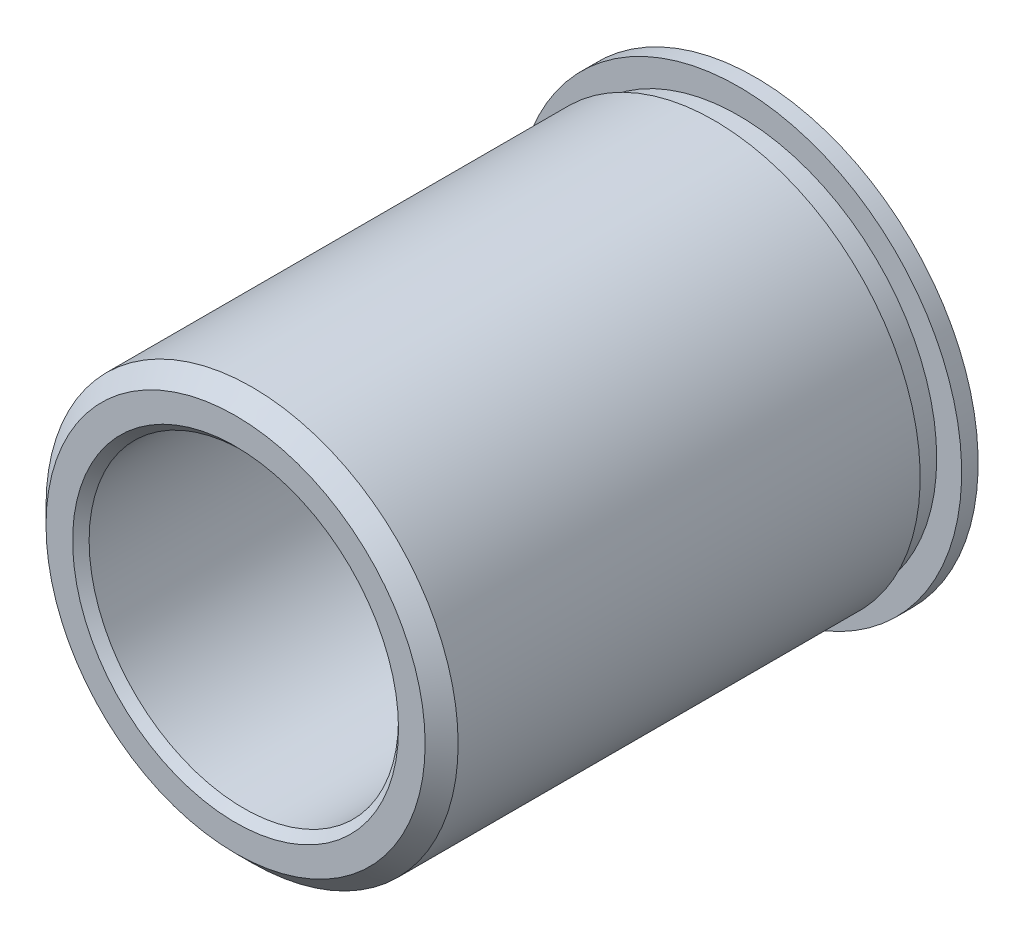
ISO-10303-21;
HEADER;
FILE_DESCRIPTION(('STEP AP214'),'2;1');
FILE_NAME('part.step','',(''),(''),'','','');
FILE_SCHEMA(('AUTOMOTIVE_DESIGN { 1 0 10303 214 1 1 1 1 }'));
ENDSEC;
DATA;
#1=APPLICATION_CONTEXT('core data for automotive mechanical design processes');
#2=APPLICATION_PROTOCOL_DEFINITION('international standard','automotive_design',2000,#1);
#3=PRODUCT_CONTEXT('',#1,'mechanical');
#4=PRODUCT('Part','Part','',(#3));
#5=PRODUCT_RELATED_PRODUCT_CATEGORY('part','',(#4));
#6=PRODUCT_DEFINITION_FORMATION('','',#4);
#7=PRODUCT_DEFINITION_CONTEXT('part definition',#1,'design');
#8=PRODUCT_DEFINITION('design','',#6,#7);
#9=PRODUCT_DEFINITION_SHAPE('','',#8);
#10=(LENGTH_UNIT() NAMED_UNIT(*) SI_UNIT(.MILLI.,.METRE.));
#11=(NAMED_UNIT(*) PLANE_ANGLE_UNIT() SI_UNIT($,.RADIAN.));
#12=(NAMED_UNIT(*) SI_UNIT($,.STERADIAN.) SOLID_ANGLE_UNIT());
#13=UNCERTAINTY_MEASURE_WITH_UNIT(LENGTH_MEASURE(1.E-05),#10,'distance_accuracy_value','');
#14=(GEOMETRIC_REPRESENTATION_CONTEXT(3) GLOBAL_UNCERTAINTY_ASSIGNED_CONTEXT((#13)) GLOBAL_UNIT_ASSIGNED_CONTEXT((#10,
#11,#12)) REPRESENTATION_CONTEXT('',''));
#15=CARTESIAN_POINT('',(0.,0.,0.));
#16=DIRECTION('',(0.,0.,1.));
#17=DIRECTION('',(1.,0.,0.));
#18=AXIS2_PLACEMENT_3D('',#15,#16,#17);
#19=CARTESIAN_POINT('',(5.30884337706539,15.5593293911014,-16.7139590633595));
#20=DIRECTION('',(0.,0.,-1.));
#21=DIRECTION('',(-1.,0.,0.));
#22=AXIS2_PLACEMENT_3D('',#19,#20,#21);
#23=PLANE('',#22);
#24=CARTESIAN_POINT('',(5.30884337706539,8.70132939110135,-16.7139590633595));
#25=DIRECTION('',(0.,0.,-1.));
#26=DIRECTION('',(-1.,0.,0.));
#27=AXIS2_PLACEMENT_3D('',#24,#25,#26);
#28=CIRCLE('',#27,5.0165);
#29=CARTESIAN_POINT('',(0.292343377065386,8.70132939110135,-16.7139590633595));
#30=VERTEX_POINT('',#29);
#31=EDGE_CURVE('E9',#30,#30,#28,.F.);
#32=ORIENTED_EDGE('',*,*,#31,.T.);
#33=EDGE_LOOP('',(#32));
#34=FACE_BOUND('',#33,.T.);
#35=CARTESIAN_POINT('',(5.30884337706539,8.70132939110135,-16.7139590633595));
#36=DIRECTION('',(0.,0.,-1.));
#37=DIRECTION('',(-1.,0.,0.));
#38=AXIS2_PLACEMENT_3D('',#35,#36,#37);
#39=CIRCLE('',#38,6.858);
#40=CARTESIAN_POINT('',(-1.54915662293461,8.70132939110135,-16.7139590633595));
#41=VERTEX_POINT('',#40);
#42=EDGE_CURVE('E51',#41,#41,#39,.T.);
#43=ORIENTED_EDGE('',*,*,#42,.T.);
#44=EDGE_LOOP('',(#43));
#45=FACE_BOUND('',#44,.T.);
#46=ADVANCED_FACE('F13',(#34,#45),#23,.T.);
#47=CARTESIAN_POINT('',(5.30884337706539,8.70132939110135,-16.7139590633595));
#48=DIRECTION('',(0.,0.,-1.));
#49=DIRECTION('',(-1.,0.,0.));
#50=AXIS2_PLACEMENT_3D('',#47,#48,#49);
#51=CYLINDRICAL_SURFACE('',#50,4.7625);
#52=CARTESIAN_POINT('',(5.30884337706539,8.70132939110135,-0.965959063359448));
#53=DIRECTION('',(0.,0.,1.));
#54=DIRECTION('',(1.,0.,0.));
#55=AXIS2_PLACEMENT_3D('',#52,#53,#54);
#56=CIRCLE('',#55,4.7625);
#57=CARTESIAN_POINT('',(10.0713433770654,8.70132939110135,-0.965959063359448));
#58=VERTEX_POINT('',#57);
#59=EDGE_CURVE('E20',#58,#58,#56,.T.);
#60=ORIENTED_EDGE('',*,*,#59,.T.);
#61=EDGE_LOOP('',(#60));
#62=FACE_BOUND('',#61,.T.);
#63=CARTESIAN_POINT('',(5.30884337706539,8.70132939110135,-16.4599590633594));
#64=DIRECTION('',(0.,0.,-1.));
#65=DIRECTION('',(-1.,0.,0.));
#66=AXIS2_PLACEMENT_3D('',#63,#64,#65);
#67=CIRCLE('',#66,4.7625);
#68=CARTESIAN_POINT('',(0.546343377065387,8.70132939110135,-16.4599590633594));
#69=VERTEX_POINT('',#68);
#70=EDGE_CURVE('E24',#69,#69,#67,.T.);
#71=ORIENTED_EDGE('',*,*,#70,.T.);
#72=EDGE_LOOP('',(#71));
#73=FACE_BOUND('',#72,.T.);
#74=ADVANCED_FACE('F74',(#62,#73),#51,.F.);
#75=CARTESIAN_POINT('',(5.30884337706539,13.4638293911014,-0.711959063359451));
#76=DIRECTION('',(0.,0.,1.));
#77=DIRECTION('',(1.,0.,0.));
#78=AXIS2_PLACEMENT_3D('',#75,#76,#77);
#79=PLANE('',#78);
#80=CARTESIAN_POINT('',(5.30884337706539,8.70132939110135,-0.711959063359451));
#81=DIRECTION('',(0.,0.,1.));
#82=DIRECTION('',(1.,0.,0.));
#83=AXIS2_PLACEMENT_3D('',#80,#81,#82);
#84=CIRCLE('',#83,5.0165);
#85=CARTESIAN_POINT('',(10.3253433770654,8.70132939110135,-0.711959063359451));
#86=VERTEX_POINT('',#85);
#87=EDGE_CURVE('E28',#86,#86,#84,.F.);
#88=ORIENTED_EDGE('',*,*,#87,.T.);
#89=EDGE_LOOP('',(#88));
#90=FACE_BOUND('',#89,.T.);
#91=CARTESIAN_POINT('',(5.30884337706539,8.70132939110135,-0.711959063359451));
#92=DIRECTION('',(0.,0.,1.));
#93=DIRECTION('',(1.,0.,0.));
#94=AXIS2_PLACEMENT_3D('',#91,#92,#93);
#95=CIRCLE('',#94,5.83564999999999);
#96=CARTESIAN_POINT('',(11.1444933770654,8.70132939110135,-0.711959063359451));
#97=VERTEX_POINT('',#96);
#98=EDGE_CURVE('E33',#97,#97,#95,.T.);
#99=ORIENTED_EDGE('',*,*,#98,.T.);
#100=EDGE_LOOP('',(#99));
#101=FACE_BOUND('',#100,.T.);
#102=ADVANCED_FACE('F79',(#90,#101),#79,.T.);
#103=CARTESIAN_POINT('',(5.30884337706539,8.70132939110135,-16.7139590633595));
#104=DIRECTION('',(0.,0.,-1.));
#105=DIRECTION('',(-1.,0.,0.));
#106=AXIS2_PLACEMENT_3D('',#103,#104,#105);
#107=CYLINDRICAL_SURFACE('',#106,6.34365);
#108=CARTESIAN_POINT('',(5.30884337706539,8.70132939110135,-1.21995906335945));
#109=DIRECTION('',(0.,0.,1.));
#110=DIRECTION('',(1.,0.,0.));
#111=AXIS2_PLACEMENT_3D('',#108,#109,#110);
#112=CIRCLE('',#111,6.34365);
#113=CARTESIAN_POINT('',(11.6524933770654,8.70132939110135,-1.21995906335945));
#114=VERTEX_POINT('',#113);
#115=EDGE_CURVE('E36',#114,#114,#112,.F.);
#116=ORIENTED_EDGE('',*,*,#115,.T.);
#117=EDGE_LOOP('',(#116));
#118=FACE_BOUND('',#117,.T.);
#119=CARTESIAN_POINT('',(5.30884337706539,8.70132939110135,-15.4439590633595));
#120=DIRECTION('',(0.,0.,-1.));
#121=DIRECTION('',(-1.,0.,0.));
#122=AXIS2_PLACEMENT_3D('',#119,#120,#121);
#123=CIRCLE('',#122,6.34365);
#124=CARTESIAN_POINT('',(-1.03480662293461,8.70132939110135,-15.4439590633595));
#125=VERTEX_POINT('',#124);
#126=EDGE_CURVE('E39',#125,#125,#123,.T.);
#127=ORIENTED_EDGE('',*,*,#126,.F.);
#128=EDGE_LOOP('',(#127));
#129=FACE_BOUND('',#128,.T.);
#130=ADVANCED_FACE('F93',(#118,#129),#107,.T.);
#131=CARTESIAN_POINT('',(5.30884337706539,15.0449793911014,-15.4439590633595));
#132=DIRECTION('',(0.,0.,-1.));
#133=DIRECTION('',(-1.,0.,0.));
#134=AXIS2_PLACEMENT_3D('',#131,#132,#133);
#135=PLANE('',#134);
#136=ORIENTED_EDGE('',*,*,#126,.T.);
#137=EDGE_LOOP('',(#136));
#138=FACE_BOUND('',#137,.T.);
#139=CARTESIAN_POINT('',(5.30884337706539,8.70132939110135,-15.4439590633595));
#140=DIRECTION('',(0.,0.,-1.));
#141=DIRECTION('',(-1.,0.,0.));
#142=AXIS2_PLACEMENT_3D('',#139,#140,#141);
#143=CIRCLE('',#142,6.08965);
#144=CARTESIAN_POINT('',(-0.780806622934612,8.70132939110135,-15.4439590633595));
#145=VERTEX_POINT('',#144);
#146=EDGE_CURVE('E42',#145,#145,#143,.T.);
#147=ORIENTED_EDGE('',*,*,#146,.F.);
#148=EDGE_LOOP('',(#147));
#149=FACE_BOUND('',#148,.T.);
#150=ADVANCED_FACE('F100',(#138,#149),#135,.T.);
#151=CARTESIAN_POINT('',(5.30884337706539,8.70132939110135,-16.7139590633595));
#152=DIRECTION('',(0.,0.,-1.));
#153=DIRECTION('',(-1.,0.,0.));
#154=AXIS2_PLACEMENT_3D('',#151,#152,#153);
#155=CYLINDRICAL_SURFACE('',#154,6.08965);
#156=ORIENTED_EDGE('',*,*,#146,.T.);
#157=EDGE_LOOP('',(#156));
#158=FACE_BOUND('',#157,.T.);
#159=CARTESIAN_POINT('',(5.30884337706539,8.70132939110135,-16.2059590633594));
#160=DIRECTION('',(0.,0.,-1.));
#161=DIRECTION('',(-1.,0.,0.));
#162=AXIS2_PLACEMENT_3D('',#159,#160,#161);
#163=CIRCLE('',#162,6.08965);
#164=CARTESIAN_POINT('',(-0.780806622934612,8.70132939110135,-16.2059590633594));
#165=VERTEX_POINT('',#164);
#166=EDGE_CURVE('E45',#165,#165,#163,.T.);
#167=ORIENTED_EDGE('',*,*,#166,.F.);
#168=EDGE_LOOP('',(#167));
#169=FACE_BOUND('',#168,.T.);
#170=ADVANCED_FACE('F70',(#158,#169),#155,.T.);
#171=CARTESIAN_POINT('',(5.30884337706539,14.7909793911014,-16.2059590633594));
#172=DIRECTION('',(0.,0.,1.));
#173=DIRECTION('',(1.,0.,0.));
#174=AXIS2_PLACEMENT_3D('',#171,#172,#173);
#175=PLANE('',#174);
#176=ORIENTED_EDGE('',*,*,#166,.T.);
#177=EDGE_LOOP('',(#176));
#178=FACE_BOUND('',#177,.T.);
#179=CARTESIAN_POINT('',(5.30884337706539,8.70132939110135,-16.2059590633594));
#180=DIRECTION('',(0.,0.,-1.));
#181=DIRECTION('',(-1.,0.,0.));
#182=AXIS2_PLACEMENT_3D('',#179,#180,#181);
#183=CIRCLE('',#182,6.858);
#184=CARTESIAN_POINT('',(-1.54915662293461,8.70132939110135,-16.2059590633594));
#185=VERTEX_POINT('',#184);
#186=EDGE_CURVE('E48',#185,#185,#183,.T.);
#187=ORIENTED_EDGE('',*,*,#186,.F.);
#188=EDGE_LOOP('',(#187));
#189=FACE_BOUND('',#188,.T.);
#190=ADVANCED_FACE('F59',(#178,#189),#175,.T.);
#191=CARTESIAN_POINT('',(5.30884337706539,8.70132939110135,-16.7139590633595));
#192=DIRECTION('',(0.,0.,-1.));
#193=DIRECTION('',(-1.,0.,0.));
#194=AXIS2_PLACEMENT_3D('',#191,#192,#193);
#195=CYLINDRICAL_SURFACE('',#194,6.858);
#196=ORIENTED_EDGE('',*,*,#186,.T.);
#197=EDGE_LOOP('',(#196));
#198=FACE_BOUND('',#197,.T.);
#199=ORIENTED_EDGE('',*,*,#42,.F.);
#200=EDGE_LOOP('',(#199));
#201=FACE_BOUND('',#200,.T.);
#202=ADVANCED_FACE('F56',(#198,#201),#195,.T.);
#203=CARTESIAN_POINT('',(5.30884337706539,8.70132939110135,-1.21995906335945));
#204=DIRECTION('',(0.,0.,-1.));
#205=DIRECTION('',(-1.,0.,0.));
#206=AXIS2_PLACEMENT_3D('',#203,#204,#205);
#207=CONICAL_SURFACE('',#206,6.34365,0.785398163397458);
#208=ORIENTED_EDGE('',*,*,#98,.F.);
#209=EDGE_LOOP('',(#208));
#210=FACE_BOUND('',#209,.T.);
#211=ORIENTED_EDGE('',*,*,#115,.F.);
#212=EDGE_LOOP('',(#211));
#213=FACE_BOUND('',#212,.T.);
#214=ADVANCED_FACE('F58',(#210,#213),#207,.T.);
#215=CARTESIAN_POINT('',(5.30884337706539,8.70132939110135,-0.711959063359451));
#216=DIRECTION('',(0.,0.,1.));
#217=DIRECTION('',(1.,0.,0.));
#218=AXIS2_PLACEMENT_3D('',#215,#216,#217);
#219=CONICAL_SURFACE('',#218,5.0165,0.785398163397445);
#220=ORIENTED_EDGE('',*,*,#59,.F.);
#221=EDGE_LOOP('',(#220));
#222=FACE_BOUND('',#221,.T.);
#223=ORIENTED_EDGE('',*,*,#87,.F.);
#224=EDGE_LOOP('',(#223));
#225=FACE_BOUND('',#224,.T.);
#226=ADVANCED_FACE('F67',(#222,#225),#219,.F.);
#227=CARTESIAN_POINT('',(5.30884337706539,8.70132939110135,-16.4599590633594));
#228=DIRECTION('',(0.,0.,-1.));
#229=DIRECTION('',(-1.,0.,0.));
#230=AXIS2_PLACEMENT_3D('',#227,#228,#229);
#231=CONICAL_SURFACE('',#230,4.7625,0.785398163397448);
#232=ORIENTED_EDGE('',*,*,#31,.F.);
#233=EDGE_LOOP('',(#232));
#234=FACE_BOUND('',#233,.T.);
#235=ORIENTED_EDGE('',*,*,#70,.F.);
#236=EDGE_LOOP('',(#235));
#237=FACE_BOUND('',#236,.T.);
#238=ADVANCED_FACE('F15',(#234,#237),#231,.F.);
#239=CLOSED_SHELL('',(#46,#74,#102,#130,#150,#170,#190,#202,#214,#226,#238));
#240=MANIFOLD_SOLID_BREP('B1',#239);
#241=ADVANCED_BREP_SHAPE_REPRESENTATION('',(#18,#240),#14);
#242=SHAPE_DEFINITION_REPRESENTATION(#9,#241);
ENDSEC;
END-ISO-10303-21;
